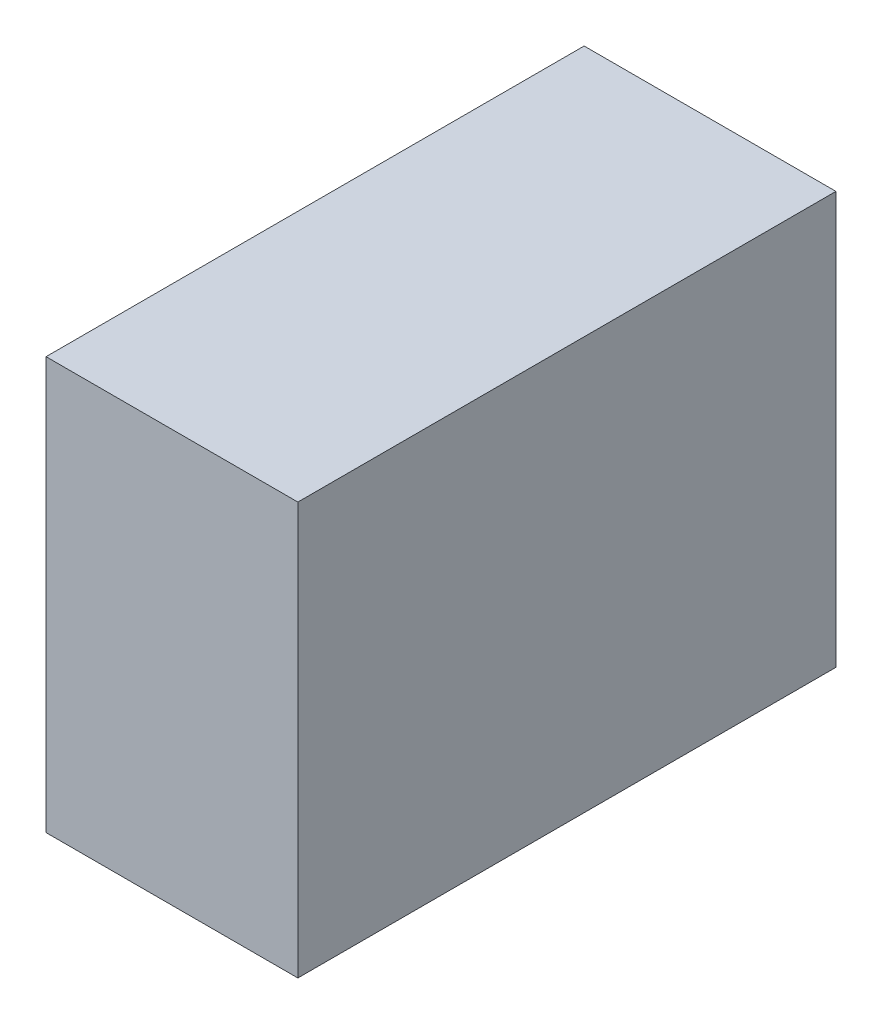
ISO-10303-21;
HEADER;
FILE_DESCRIPTION(('STEP AP214'),'2;1');
FILE_NAME('part.step','',(''),(''),'','','');
FILE_SCHEMA(('AUTOMOTIVE_DESIGN { 1 0 10303 214 1 1 1 1 }'));
ENDSEC;
DATA;
#1=APPLICATION_CONTEXT('core data for automotive mechanical design processes');
#2=APPLICATION_PROTOCOL_DEFINITION('international standard','automotive_design',2000,#1);
#3=PRODUCT_CONTEXT('',#1,'mechanical');
#4=PRODUCT('Part','Part','',(#3));
#5=PRODUCT_RELATED_PRODUCT_CATEGORY('part','',(#4));
#6=PRODUCT_DEFINITION_FORMATION('','',#4);
#7=PRODUCT_DEFINITION_CONTEXT('part definition',#1,'design');
#8=PRODUCT_DEFINITION('design','',#6,#7);
#9=PRODUCT_DEFINITION_SHAPE('','',#8);
#10=(LENGTH_UNIT() NAMED_UNIT(*) SI_UNIT(.MILLI.,.METRE.));
#11=(NAMED_UNIT(*) PLANE_ANGLE_UNIT() SI_UNIT($,.RADIAN.));
#12=(NAMED_UNIT(*) SI_UNIT($,.STERADIAN.) SOLID_ANGLE_UNIT());
#13=UNCERTAINTY_MEASURE_WITH_UNIT(LENGTH_MEASURE(1.E-05),#10,'distance_accuracy_value','');
#14=(GEOMETRIC_REPRESENTATION_CONTEXT(3) GLOBAL_UNCERTAINTY_ASSIGNED_CONTEXT((#13)) GLOBAL_UNIT_ASSIGNED_CONTEXT((#10,
#11,#12)) REPRESENTATION_CONTEXT('',''));
#15=CARTESIAN_POINT('',(0.,0.,0.));
#16=DIRECTION('',(0.,0.,1.));
#17=DIRECTION('',(1.,0.,0.));
#18=AXIS2_PLACEMENT_3D('',#15,#16,#17);
#19=CARTESIAN_POINT('',(0.,0.,71.8));
#20=DIRECTION('',(1.,0.,0.));
#21=DIRECTION('',(0.,1.,0.));
#22=AXIS2_PLACEMENT_3D('',#19,#20,#21);
#23=PLANE('',#22);
#24=DIRECTION('',(0.,-1.,0.));
#25=VECTOR('',#24,1.);
#26=CARTESIAN_POINT('',(0.,0.,0.));
#27=LINE('',#26,#25);
#28=CARTESIAN_POINT('',(0.,55.,0.));
#29=VERTEX_POINT('',#28);
#30=CARTESIAN_POINT('',(0.,0.,0.));
#31=VERTEX_POINT('',#30);
#32=EDGE_CURVE('E107',#29,#31,#27,.T.);
#33=ORIENTED_EDGE('',*,*,#32,.T.);
#34=DIRECTION('',(0.,0.,-1.));
#35=VECTOR('',#34,1.);
#36=CARTESIAN_POINT('',(0.,0.,71.8));
#37=LINE('',#36,#35);
#38=CARTESIAN_POINT('',(0.,0.,71.8));
#39=VERTEX_POINT('',#38);
#40=EDGE_CURVE('E11',#39,#31,#37,.T.);
#41=ORIENTED_EDGE('',*,*,#40,.F.);
#42=DIRECTION('',(0.,-1.,0.));
#43=VECTOR('',#42,1.);
#44=CARTESIAN_POINT('',(0.,0.,71.8));
#45=LINE('',#44,#43);
#46=CARTESIAN_POINT('',(0.,55.,71.8));
#47=VERTEX_POINT('',#46);
#48=EDGE_CURVE('E91',#47,#39,#45,.T.);
#49=ORIENTED_EDGE('',*,*,#48,.F.);
#50=DIRECTION('',(0.,0.,-1.));
#51=VECTOR('',#50,1.);
#52=CARTESIAN_POINT('',(0.,55.,71.8));
#53=LINE('',#52,#51);
#54=EDGE_CURVE('E103',#47,#29,#53,.T.);
#55=ORIENTED_EDGE('',*,*,#54,.T.);
#56=EDGE_LOOP('',(#33,#41,#49,#55));
#57=FACE_BOUND('',#56,.T.);
#58=ADVANCED_FACE('F39',(#57),#23,.F.);
#59=CARTESIAN_POINT('',(0.,0.,71.8));
#60=DIRECTION('',(0.,1.,0.));
#61=DIRECTION('',(0.,0.,1.));
#62=AXIS2_PLACEMENT_3D('',#59,#60,#61);
#63=PLANE('',#62);
#64=DIRECTION('',(1.,0.,0.));
#65=VECTOR('',#64,1.);
#66=CARTESIAN_POINT('',(0.,0.,0.));
#67=LINE('',#66,#65);
#68=CARTESIAN_POINT('',(33.6,0.,0.));
#69=VERTEX_POINT('',#68);
#70=EDGE_CURVE('E96',#31,#69,#67,.T.);
#71=ORIENTED_EDGE('',*,*,#70,.T.);
#72=DIRECTION('',(0.,0.,-1.));
#73=VECTOR('',#72,1.);
#74=CARTESIAN_POINT('',(33.6,0.,71.8));
#75=LINE('',#74,#73);
#76=CARTESIAN_POINT('',(33.6,0.,71.8));
#77=VERTEX_POINT('',#76);
#78=EDGE_CURVE('E48',#77,#69,#75,.T.);
#79=ORIENTED_EDGE('',*,*,#78,.F.);
#80=DIRECTION('',(1.,0.,0.));
#81=VECTOR('',#80,1.);
#82=CARTESIAN_POINT('',(0.,0.,71.8));
#83=LINE('',#82,#81);
#84=EDGE_CURVE('E86',#39,#77,#83,.T.);
#85=ORIENTED_EDGE('',*,*,#84,.F.);
#86=ORIENTED_EDGE('',*,*,#40,.T.);
#87=EDGE_LOOP('',(#71,#79,#85,#86));
#88=FACE_BOUND('',#87,.T.);
#89=ADVANCED_FACE('F95',(#88),#63,.F.);
#90=CARTESIAN_POINT('',(33.6,0.,71.8));
#91=DIRECTION('',(-1.,0.,0.));
#92=DIRECTION('',(0.,-1.,0.));
#93=AXIS2_PLACEMENT_3D('',#90,#91,#92);
#94=PLANE('',#93);
#95=DIRECTION('',(0.,1.,0.));
#96=VECTOR('',#95,1.);
#97=CARTESIAN_POINT('',(33.6,0.,0.));
#98=LINE('',#97,#96);
#99=CARTESIAN_POINT('',(33.6,55.,0.));
#100=VERTEX_POINT('',#99);
#101=EDGE_CURVE('E73',#69,#100,#98,.T.);
#102=ORIENTED_EDGE('',*,*,#101,.T.);
#103=DIRECTION('',(0.,0.,-1.));
#104=VECTOR('',#103,1.);
#105=CARTESIAN_POINT('',(33.6,55.,71.8));
#106=LINE('',#105,#104);
#107=CARTESIAN_POINT('',(33.6,55.,71.8));
#108=VERTEX_POINT('',#107);
#109=EDGE_CURVE('E98',#108,#100,#106,.T.);
#110=ORIENTED_EDGE('',*,*,#109,.F.);
#111=DIRECTION('',(0.,1.,0.));
#112=VECTOR('',#111,1.);
#113=CARTESIAN_POINT('',(33.6,0.,71.8));
#114=LINE('',#113,#112);
#115=EDGE_CURVE('E89',#77,#108,#114,.T.);
#116=ORIENTED_EDGE('',*,*,#115,.F.);
#117=ORIENTED_EDGE('',*,*,#78,.T.);
#118=EDGE_LOOP('',(#102,#110,#116,#117));
#119=FACE_BOUND('',#118,.T.);
#120=ADVANCED_FACE('F99',(#119),#94,.F.);
#121=CARTESIAN_POINT('',(0.,55.,71.8));
#122=DIRECTION('',(0.,-1.,0.));
#123=DIRECTION('',(0.,0.,-1.));
#124=AXIS2_PLACEMENT_3D('',#121,#122,#123);
#125=PLANE('',#124);
#126=DIRECTION('',(-1.,0.,0.));
#127=VECTOR('',#126,1.);
#128=CARTESIAN_POINT('',(0.,55.,0.));
#129=LINE('',#128,#127);
#130=EDGE_CURVE('E79',#100,#29,#129,.T.);
#131=ORIENTED_EDGE('',*,*,#130,.T.);
#132=ORIENTED_EDGE('',*,*,#54,.F.);
#133=DIRECTION('',(-1.,0.,0.));
#134=VECTOR('',#133,1.);
#135=CARTESIAN_POINT('',(0.,55.,71.8));
#136=LINE('',#135,#134);
#137=EDGE_CURVE('E56',#108,#47,#136,.T.);
#138=ORIENTED_EDGE('',*,*,#137,.F.);
#139=ORIENTED_EDGE('',*,*,#109,.T.);
#140=EDGE_LOOP('',(#131,#132,#138,#139));
#141=FACE_BOUND('',#140,.T.);
#142=ADVANCED_FACE('F120',(#141),#125,.F.);
#143=CARTESIAN_POINT('',(0.,0.,71.8));
#144=DIRECTION('',(0.,0.,-1.));
#145=DIRECTION('',(-1.,0.,0.));
#146=AXIS2_PLACEMENT_3D('',#143,#144,#145);
#147=PLANE('',#146);
#148=ORIENTED_EDGE('',*,*,#48,.T.);
#149=ORIENTED_EDGE('',*,*,#84,.T.);
#150=ORIENTED_EDGE('',*,*,#115,.T.);
#151=ORIENTED_EDGE('',*,*,#137,.T.);
#152=EDGE_LOOP('',(#148,#149,#150,#151));
#153=FACE_BOUND('',#152,.T.);
#154=ADVANCED_FACE('F87',(#153),#147,.F.);
#155=CARTESIAN_POINT('',(0.,0.,0.));
#156=DIRECTION('',(0.,0.,-1.));
#157=DIRECTION('',(-1.,0.,0.));
#158=AXIS2_PLACEMENT_3D('',#155,#156,#157);
#159=PLANE('',#158);
#160=ORIENTED_EDGE('',*,*,#32,.F.);
#161=ORIENTED_EDGE('',*,*,#130,.F.);
#162=ORIENTED_EDGE('',*,*,#101,.F.);
#163=ORIENTED_EDGE('',*,*,#70,.F.);
#164=EDGE_LOOP('',(#160,#161,#162,#163));
#165=FACE_BOUND('',#164,.T.);
#166=ADVANCED_FACE('F123',(#165),#159,.T.);
#167=CLOSED_SHELL('',(#58,#89,#120,#142,#154,#166));
#168=MANIFOLD_SOLID_BREP('B2',#167);
#169=ADVANCED_BREP_SHAPE_REPRESENTATION('',(#18,#168),#14);
#170=SHAPE_DEFINITION_REPRESENTATION(#9,#169);
ENDSEC;
END-ISO-10303-21;
